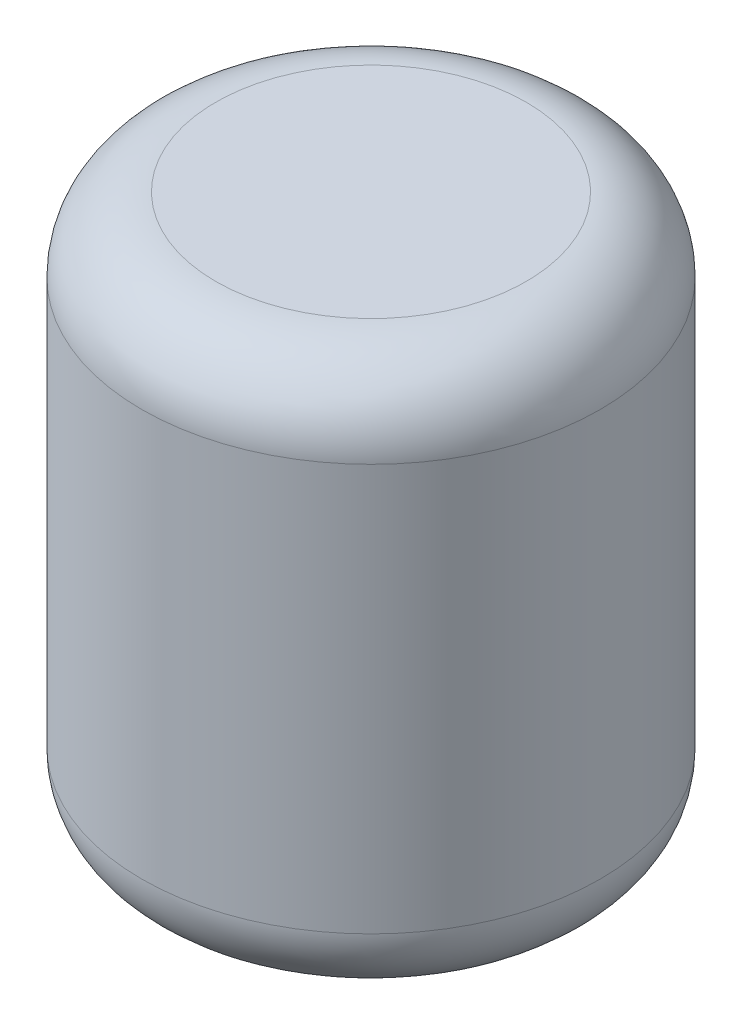
ISO-10303-21;
HEADER;
FILE_DESCRIPTION(('STEP AP214'),'2;1');
FILE_NAME('part.step','',(''),(''),'','','');
FILE_SCHEMA(('AUTOMOTIVE_DESIGN { 1 0 10303 214 1 1 1 1 }'));
ENDSEC;
DATA;
#1=APPLICATION_CONTEXT('core data for automotive mechanical design processes');
#2=APPLICATION_PROTOCOL_DEFINITION('international standard','automotive_design',2000,#1);
#3=PRODUCT_CONTEXT('',#1,'mechanical');
#4=PRODUCT('Part','Part','',(#3));
#5=PRODUCT_RELATED_PRODUCT_CATEGORY('part','',(#4));
#6=PRODUCT_DEFINITION_FORMATION('','',#4);
#7=PRODUCT_DEFINITION_CONTEXT('part definition',#1,'design');
#8=PRODUCT_DEFINITION('design','',#6,#7);
#9=PRODUCT_DEFINITION_SHAPE('','',#8);
#10=(LENGTH_UNIT() NAMED_UNIT(*) SI_UNIT(.MILLI.,.METRE.));
#11=(NAMED_UNIT(*) PLANE_ANGLE_UNIT() SI_UNIT($,.RADIAN.));
#12=(NAMED_UNIT(*) SI_UNIT($,.STERADIAN.) SOLID_ANGLE_UNIT());
#13=UNCERTAINTY_MEASURE_WITH_UNIT(LENGTH_MEASURE(1.E-05),#10,'distance_accuracy_value','');
#14=(GEOMETRIC_REPRESENTATION_CONTEXT(3) GLOBAL_UNCERTAINTY_ASSIGNED_CONTEXT((#13)) GLOBAL_UNIT_ASSIGNED_CONTEXT((#10,
#11,#12)) REPRESENTATION_CONTEXT('',''));
#15=CARTESIAN_POINT('',(0.,0.,0.));
#16=DIRECTION('',(0.,0.,1.));
#17=DIRECTION('',(1.,0.,0.));
#18=AXIS2_PLACEMENT_3D('',#15,#16,#17);
#19=CARTESIAN_POINT('',(0.,37.5,0.));
#20=DIRECTION('',(0.,-1.,0.));
#21=DIRECTION('',(0.,0.,-1.));
#22=AXIS2_PLACEMENT_3D('',#19,#20,#21);
#23=CYLINDRICAL_SURFACE('',#22,31.);
#24=CARTESIAN_POINT('',(0.,27.5,0.));
#25=DIRECTION('',(0.,1.,0.));
#26=DIRECTION('',(0.,0.,1.));
#27=AXIS2_PLACEMENT_3D('',#24,#25,#26);
#28=CIRCLE('',#27,31.);
#29=CARTESIAN_POINT('',(0.,27.5,31.));
#30=VERTEX_POINT('',#29);
#31=EDGE_CURVE('E41',#30,#30,#28,.F.);
#32=ORIENTED_EDGE('',*,*,#31,.T.);
#33=EDGE_LOOP('',(#32));
#34=FACE_BOUND('',#33,.T.);
#35=CARTESIAN_POINT('',(0.,-27.5,0.));
#36=DIRECTION('',(0.,1.,0.));
#37=DIRECTION('',(0.,0.,1.));
#38=AXIS2_PLACEMENT_3D('',#35,#36,#37);
#39=CIRCLE('',#38,31.);
#40=CARTESIAN_POINT('',(0.,-27.5,31.));
#41=VERTEX_POINT('',#40);
#42=EDGE_CURVE('E45',#41,#41,#39,.T.);
#43=ORIENTED_EDGE('',*,*,#42,.T.);
#44=EDGE_LOOP('',(#43));
#45=FACE_BOUND('',#44,.T.);
#46=ADVANCED_FACE('F34',(#34,#45),#23,.T.);
#47=CARTESIAN_POINT('',(0.,37.5,0.));
#48=DIRECTION('',(0.,1.,0.));
#49=DIRECTION('',(0.,0.,1.));
#50=AXIS2_PLACEMENT_3D('',#47,#48,#49);
#51=PLANE('',#50);
#52=CARTESIAN_POINT('',(0.,37.5,0.));
#53=DIRECTION('',(0.,1.,0.));
#54=DIRECTION('',(0.,0.,1.));
#55=AXIS2_PLACEMENT_3D('',#52,#53,#54);
#56=CIRCLE('',#55,21.);
#57=CARTESIAN_POINT('',(0.,37.5,21.));
#58=VERTEX_POINT('',#57);
#59=EDGE_CURVE('E49',#58,#58,#56,.T.);
#60=ORIENTED_EDGE('',*,*,#59,.T.);
#61=EDGE_LOOP('',(#60));
#62=FACE_BOUND('',#61,.T.);
#63=ADVANCED_FACE('F55',(#62),#51,.T.);
#64=CARTESIAN_POINT('',(0.,-37.5,0.));
#65=DIRECTION('',(0.,1.,0.));
#66=DIRECTION('',(0.,0.,1.));
#67=AXIS2_PLACEMENT_3D('',#64,#65,#66);
#68=PLANE('',#67);
#69=CARTESIAN_POINT('',(0.,-37.5,0.));
#70=DIRECTION('',(0.,1.,0.));
#71=DIRECTION('',(0.,0.,1.));
#72=AXIS2_PLACEMENT_3D('',#69,#70,#71);
#73=CIRCLE('',#72,21.);
#74=CARTESIAN_POINT('',(0.,-37.5,21.));
#75=VERTEX_POINT('',#74);
#76=EDGE_CURVE('E10',#75,#75,#73,.F.);
#77=ORIENTED_EDGE('',*,*,#76,.T.);
#78=EDGE_LOOP('',(#77));
#79=FACE_BOUND('',#78,.T.);
#80=ADVANCED_FACE('F59',(#79),#68,.F.);
#81=CARTESIAN_POINT('',(0.,27.5,0.));
#82=DIRECTION('',(0.,1.,0.));
#83=DIRECTION('',(0.,0.,1.));
#84=AXIS2_PLACEMENT_3D('',#81,#82,#83);
#85=TOROIDAL_SURFACE('',#84,21.,10.);
#86=ORIENTED_EDGE('',*,*,#31,.F.);
#87=EDGE_LOOP('',(#86));
#88=FACE_BOUND('',#87,.T.);
#89=ORIENTED_EDGE('',*,*,#59,.F.);
#90=EDGE_LOOP('',(#89));
#91=FACE_BOUND('',#90,.T.);
#92=ADVANCED_FACE('F57',(#88,#91),#85,.T.);
#93=CARTESIAN_POINT('',(0.,-27.5,0.));
#94=DIRECTION('',(0.,1.,0.));
#95=DIRECTION('',(0.,0.,1.));
#96=AXIS2_PLACEMENT_3D('',#93,#94,#95);
#97=TOROIDAL_SURFACE('',#96,21.,10.);
#98=ORIENTED_EDGE('',*,*,#76,.F.);
#99=EDGE_LOOP('',(#98));
#100=FACE_BOUND('',#99,.T.);
#101=ORIENTED_EDGE('',*,*,#42,.F.);
#102=EDGE_LOOP('',(#101));
#103=FACE_BOUND('',#102,.T.);
#104=ADVANCED_FACE('F36',(#100,#103),#97,.T.);
#105=CLOSED_SHELL('',(#46,#63,#80,#92,#104));
#106=MANIFOLD_SOLID_BREP('B2',#105);
#107=ADVANCED_BREP_SHAPE_REPRESENTATION('',(#18,#106),#14);
#108=SHAPE_DEFINITION_REPRESENTATION(#9,#107);
ENDSEC;
END-ISO-10303-21;
